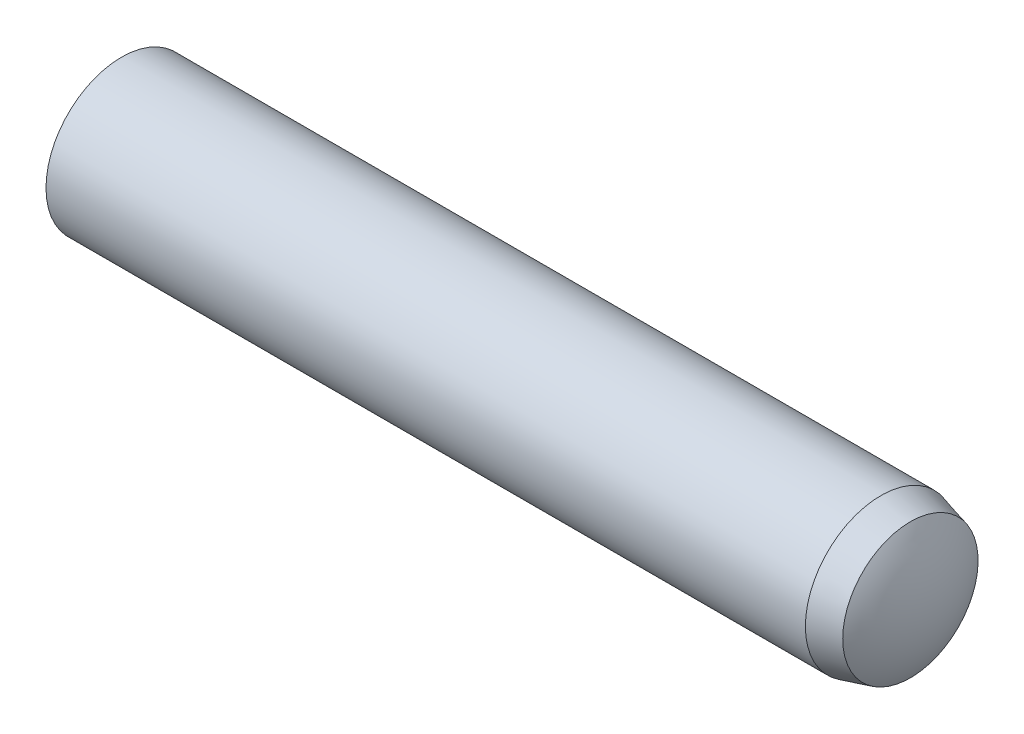
ISO-10303-21;
HEADER;
FILE_DESCRIPTION(('STEP AP214'),'2;1');
FILE_NAME('part.step','',(''),(''),'','','');
FILE_SCHEMA(('AUTOMOTIVE_DESIGN { 1 0 10303 214 1 1 1 1 }'));
ENDSEC;
DATA;
#1=APPLICATION_CONTEXT('core data for automotive mechanical design processes');
#2=APPLICATION_PROTOCOL_DEFINITION('international standard','automotive_design',2000,#1);
#3=PRODUCT_CONTEXT('',#1,'mechanical');
#4=PRODUCT('Part','Part','',(#3));
#5=PRODUCT_RELATED_PRODUCT_CATEGORY('part','',(#4));
#6=PRODUCT_DEFINITION_FORMATION('','',#4);
#7=PRODUCT_DEFINITION_CONTEXT('part definition',#1,'design');
#8=PRODUCT_DEFINITION('design','',#6,#7);
#9=PRODUCT_DEFINITION_SHAPE('','',#8);
#10=(LENGTH_UNIT() NAMED_UNIT(*) SI_UNIT(.MILLI.,.METRE.));
#11=(NAMED_UNIT(*) PLANE_ANGLE_UNIT() SI_UNIT($,.RADIAN.));
#12=(NAMED_UNIT(*) SI_UNIT($,.STERADIAN.) SOLID_ANGLE_UNIT());
#13=UNCERTAINTY_MEASURE_WITH_UNIT(LENGTH_MEASURE(1.E-05),#10,'distance_accuracy_value','');
#14=(GEOMETRIC_REPRESENTATION_CONTEXT(3) GLOBAL_UNCERTAINTY_ASSIGNED_CONTEXT((#13)) GLOBAL_UNIT_ASSIGNED_CONTEXT((#10,
#11,#12)) REPRESENTATION_CONTEXT('',''));
#15=CARTESIAN_POINT('',(0.,0.,0.));
#16=DIRECTION('',(0.,0.,1.));
#17=DIRECTION('',(1.,0.,0.));
#18=AXIS2_PLACEMENT_3D('',#15,#16,#17);
#19=CARTESIAN_POINT('',(-11.,0.,0.));
#20=DIRECTION('',(1.,0.,0.));
#21=DIRECTION('',(0.,0.,-1.));
#22=AXIS2_PLACEMENT_3D('',#19,#20,#21);
#23=CYLINDRICAL_SURFACE('',#22,2.);
#24=CARTESIAN_POINT('',(9.7,0.,0.));
#25=DIRECTION('',(-1.,0.,0.));
#26=DIRECTION('',(0.,0.,1.));
#27=AXIS2_PLACEMENT_3D('',#24,#25,#26);
#28=CIRCLE('',#27,1.99999999999999);
#29=CARTESIAN_POINT('',(9.7,0.,1.99999999999999));
#30=VERTEX_POINT('',#29);
#31=EDGE_CURVE('E11',#30,#30,#28,.T.);
#32=ORIENTED_EDGE('',*,*,#31,.T.);
#33=EDGE_LOOP('',(#32));
#34=FACE_BOUND('',#33,.T.);
#35=CARTESIAN_POINT('',(-10.4,0.,0.));
#36=DIRECTION('',(-1.,0.,0.));
#37=DIRECTION('',(0.,0.,1.));
#38=AXIS2_PLACEMENT_3D('',#35,#36,#37);
#39=CIRCLE('',#38,2.);
#40=CARTESIAN_POINT('',(-10.4,0.,1.99999999999999));
#41=VERTEX_POINT('',#40);
#42=EDGE_CURVE('E37',#41,#41,#39,.T.);
#43=ORIENTED_EDGE('',*,*,#42,.F.);
#44=EDGE_LOOP('',(#43));
#45=FACE_BOUND('',#44,.T.);
#46=ADVANCED_FACE('F17',(#34,#45),#23,.T.);
#47=CARTESIAN_POINT('',(9.7,0.,0.));
#48=DIRECTION('',(-1.,0.,0.));
#49=DIRECTION('',(0.,0.,1.));
#50=AXIS2_PLACEMENT_3D('',#47,#48,#49);
#51=CONICAL_SURFACE('',#50,1.99999999999999,0.261799387799151);
#52=CARTESIAN_POINT('',(10.48,0.,0.));
#53=DIRECTION('',(-1.,0.,0.));
#54=DIRECTION('',(0.,0.,1.));
#55=AXIS2_PLACEMENT_3D('',#52,#53,#54);
#56=CIRCLE('',#55,1.79099962990372);
#57=CARTESIAN_POINT('',(10.48,0.,1.79099962990372));
#58=VERTEX_POINT('',#57);
#59=EDGE_CURVE('E24',#58,#58,#56,.T.);
#60=ORIENTED_EDGE('',*,*,#59,.T.);
#61=EDGE_LOOP('',(#60));
#62=FACE_BOUND('',#61,.T.);
#63=ORIENTED_EDGE('',*,*,#31,.F.);
#64=EDGE_LOOP('',(#63));
#65=FACE_BOUND('',#64,.T.);
#66=ADVANCED_FACE('F43',(#62,#65),#51,.T.);
#67=CARTESIAN_POINT('',(7.65569262085074,0.,0.));
#68=DIRECTION('',(-1.,0.,0.));
#69=DIRECTION('',(0.,1.,0.));
#70=AXIS2_PLACEMENT_3D('',#67,#68,#69);
#71=SPHERICAL_SURFACE('',#70,3.34430737914926);
#72=CARTESIAN_POINT('',(11.,0.,0.));
#73=VERTEX_POINT('',#72);
#74=VERTEX_LOOP('',#73);
#75=FACE_BOUND('',#74,.T.);
#76=ORIENTED_EDGE('',*,*,#59,.F.);
#77=EDGE_LOOP('',(#76));
#78=FACE_BOUND('',#77,.T.);
#79=ADVANCED_FACE('F33',(#75,#78),#71,.T.);
#80=CARTESIAN_POINT('',(-7.36666666666666,0.,0.));
#81=DIRECTION('',(-1.,0.,0.));
#82=DIRECTION('',(0.,1.,0.));
#83=AXIS2_PLACEMENT_3D('',#80,#81,#82);
#84=SPHERICAL_SURFACE('',#83,3.63333333333334);
#85=CARTESIAN_POINT('',(-11.,0.,0.));
#86=VERTEX_POINT('',#85);
#87=VERTEX_LOOP('',#86);
#88=FACE_BOUND('',#87,.T.);
#89=ORIENTED_EDGE('',*,*,#42,.T.);
#90=EDGE_LOOP('',(#89));
#91=FACE_BOUND('',#90,.T.);
#92=ADVANCED_FACE('F30',(#88,#91),#84,.T.);
#93=CLOSED_SHELL('',(#46,#66,#79,#92));
#94=MANIFOLD_SOLID_BREP('B1',#93);
#95=ADVANCED_BREP_SHAPE_REPRESENTATION('',(#18,#94),#14);
#96=SHAPE_DEFINITION_REPRESENTATION(#9,#95);
ENDSEC;
END-ISO-10303-21;
